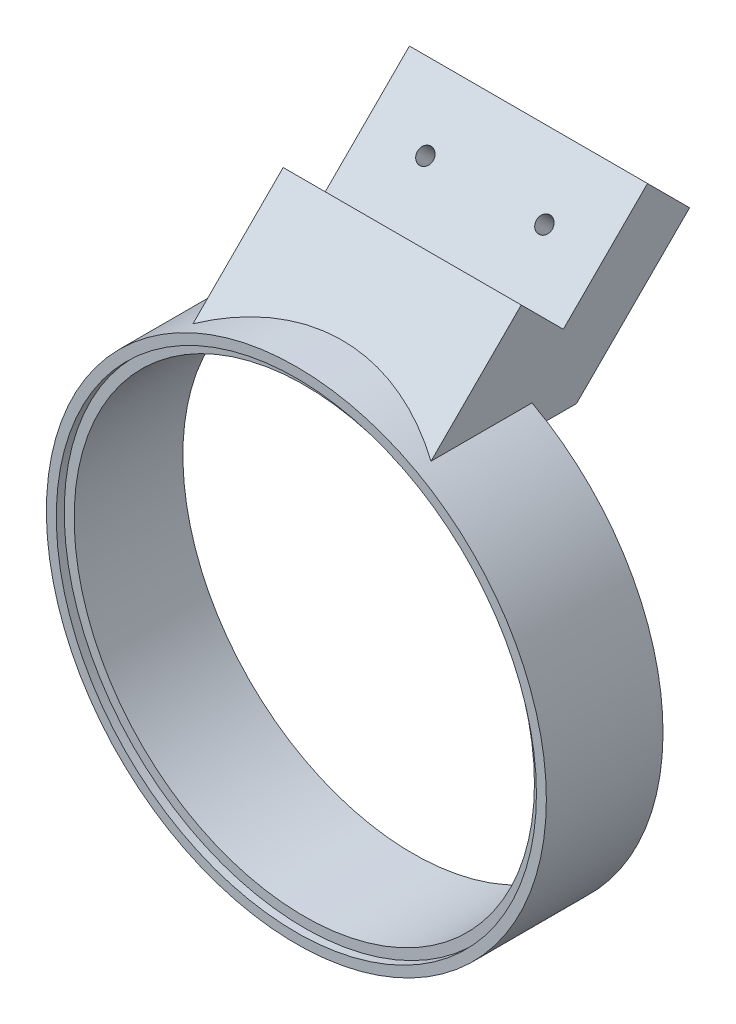
ISO-10303-21;
HEADER;
FILE_DESCRIPTION(('STEP AP214'),'2;1');
FILE_NAME('part.step','',(''),(''),'','','');
FILE_SCHEMA(('AUTOMOTIVE_DESIGN { 1 0 10303 214 1 1 1 1 }'));
ENDSEC;
DATA;
#1=APPLICATION_CONTEXT('core data for automotive mechanical design processes');
#2=APPLICATION_PROTOCOL_DEFINITION('international standard','automotive_design',2000,#1);
#3=PRODUCT_CONTEXT('',#1,'mechanical');
#4=PRODUCT('Part','Part','',(#3));
#5=PRODUCT_RELATED_PRODUCT_CATEGORY('part','',(#4));
#6=PRODUCT_DEFINITION_FORMATION('','',#4);
#7=PRODUCT_DEFINITION_CONTEXT('part definition',#1,'design');
#8=PRODUCT_DEFINITION('design','',#6,#7);
#9=PRODUCT_DEFINITION_SHAPE('','',#8);
#10=(LENGTH_UNIT() NAMED_UNIT(*) SI_UNIT(.MILLI.,.METRE.));
#11=(NAMED_UNIT(*) PLANE_ANGLE_UNIT() SI_UNIT($,.RADIAN.));
#12=(NAMED_UNIT(*) SI_UNIT($,.STERADIAN.) SOLID_ANGLE_UNIT());
#13=UNCERTAINTY_MEASURE_WITH_UNIT(LENGTH_MEASURE(1.E-05),#10,'distance_accuracy_value','');
#14=(GEOMETRIC_REPRESENTATION_CONTEXT(3) GLOBAL_UNCERTAINTY_ASSIGNED_CONTEXT((#13)) GLOBAL_UNIT_ASSIGNED_CONTEXT((#10,
#11,#12)) REPRESENTATION_CONTEXT('',''));
#15=CARTESIAN_POINT('',(0.,0.,0.));
#16=DIRECTION('',(0.,0.,1.));
#17=DIRECTION('',(1.,0.,0.));
#18=AXIS2_PLACEMENT_3D('',#15,#16,#17);
#19=CARTESIAN_POINT('',(0.,0.,29.4));
#20=DIRECTION('',(0.,0.,1.));
#21=DIRECTION('',(1.,0.,0.));
#22=AXIS2_PLACEMENT_3D('',#19,#20,#21);
#23=PLANE('',#22);
#24=CARTESIAN_POINT('',(0.,0.,29.4));
#25=DIRECTION('',(0.,0.,1.));
#26=DIRECTION('',(1.,0.,0.));
#27=AXIS2_PLACEMENT_3D('',#24,#25,#26);
#28=CIRCLE('',#27,60.5);
#29=CARTESIAN_POINT('',(60.5,0.,29.4));
#30=VERTEX_POINT('',#29);
#31=EDGE_CURVE('E157',#30,#30,#28,.T.);
#32=ORIENTED_EDGE('',*,*,#31,.F.);
#33=EDGE_LOOP('',(#32));
#34=FACE_BOUND('',#33,.T.);
#35=CARTESIAN_POINT('',(0.,0.,29.4));
#36=DIRECTION('',(0.,0.,1.));
#37=DIRECTION('',(1.,0.,0.));
#38=AXIS2_PLACEMENT_3D('',#35,#36,#37);
#39=CIRCLE('',#38,63.);
#40=CARTESIAN_POINT('',(63.,0.,29.4));
#41=VERTEX_POINT('',#40);
#42=EDGE_CURVE('E11',#41,#41,#39,.T.);
#43=ORIENTED_EDGE('',*,*,#42,.T.);
#44=EDGE_LOOP('',(#43));
#45=FACE_BOUND('',#44,.T.);
#46=ADVANCED_FACE('F34',(#34,#45),#23,.T.);
#47=CARTESIAN_POINT('',(30.,55.3985559378582,29.4));
#48=DIRECTION('',(1.,0.,0.));
#49=DIRECTION('',(0.,0.,-1.));
#50=AXIS2_PLACEMENT_3D('',#47,#48,#49);
#51=PLANE('',#50);
#52=DIRECTION('',(0.,0.707106781186544,0.707106781186551));
#53=VECTOR('',#52,1.);
#54=CARTESIAN_POINT('',(30.,0.492926244754555,-117.332036564298));
#55=LINE('',#54,#53);
#56=CARTESIAN_POINT('',(30.,78.1279881132385,-39.6969746958128));
#57=VERTEX_POINT('',#56);
#58=CARTESIAN_POINT('',(30.,88.7345898310367,-29.0903729780145));
#59=VERTEX_POINT('',#58);
#60=EDGE_CURVE('E100',#57,#59,#55,.T.);
#61=ORIENTED_EDGE('',*,*,#60,.T.);
#62=DIRECTION('',(0.,0.707106781186551,-0.707106781186544));
#63=VECTOR('',#62,1.);
#64=CARTESIAN_POINT('',(30.,67.5213863954401,-7.87716954241816));
#65=LINE('',#64,#63);
#66=CARTESIAN_POINT('',(30.,67.5213863954401,-7.87716954241816));
#67=VERTEX_POINT('',#66);
#68=EDGE_CURVE('E111',#67,#59,#65,.T.);
#69=ORIENTED_EDGE('',*,*,#68,.F.);
#70=DIRECTION('',(0.,-0.707106781186544,-0.707106781186551));
#71=VECTOR('',#70,1.);
#72=CARTESIAN_POINT('',(30.,78.1279881132386,2.72943217538041));
#73=LINE('',#72,#71);
#74=CARTESIAN_POINT('',(30.,78.1279881132386,2.72943217538041));
#75=VERTEX_POINT('',#74);
#76=EDGE_CURVE('E123',#75,#67,#73,.T.);
#77=ORIENTED_EDGE('',*,*,#76,.F.);
#78=DIRECTION('',(0.,0.707106781186548,-0.707106781186548));
#79=VECTOR('',#78,1.);
#80=CARTESIAN_POINT('',(30.,113.483327172566,-32.625906883947));
#81=LINE('',#80,#79);
#82=CARTESIAN_POINT('',(30.,55.3985559378582,25.4588643507606));
#83=VERTEX_POINT('',#82);
#84=EDGE_CURVE('E130',#83,#75,#81,.T.);
#85=ORIENTED_EDGE('',*,*,#84,.F.);
#86=DIRECTION('',(0.,0.,-1.));
#87=VECTOR('',#86,1.);
#88=CARTESIAN_POINT('',(30.,55.3985559378582,29.4));
#89=LINE('',#88,#87);
#90=CARTESIAN_POINT('',(30.,55.3985559378582,0.));
#91=VERTEX_POINT('',#90);
#92=EDGE_CURVE('E150',#83,#91,#89,.T.);
#93=ORIENTED_EDGE('',*,*,#92,.T.);
#94=DIRECTION('',(0.,-1.,0.));
#95=VECTOR('',#94,1.);
#96=CARTESIAN_POINT('',(30.,0.,0.));
#97=LINE('',#96,#95);
#98=CARTESIAN_POINT('',(30.,49.6386945839634,0.));
#99=VERTEX_POINT('',#98);
#100=EDGE_CURVE('E143',#91,#99,#97,.T.);
#101=ORIENTED_EDGE('',*,*,#100,.T.);
#102=DIRECTION('',(0.,0.,1.));
#103=VECTOR('',#102,1.);
#104=CARTESIAN_POINT('',(30.,49.6386945839634,-53.8391103195437));
#105=LINE('',#104,#103);
#106=CARTESIAN_POINT('',(30.,49.6386945839634,-11.207681166538));
#107=VERTEX_POINT('',#106);
#108=EDGE_CURVE('E135',#107,#99,#105,.T.);
#109=ORIENTED_EDGE('',*,*,#108,.F.);
#110=DIRECTION('',(0.,-0.707106781186551,0.707106781186544));
#111=VECTOR('',#110,1.);
#112=CARTESIAN_POINT('',(30.,92.2701237369695,-53.8391103195436));
#113=LINE('',#112,#111);
#114=EDGE_CURVE('E113',#57,#107,#113,.T.);
#115=ORIENTED_EDGE('',*,*,#114,.F.);
#116=EDGE_LOOP('',(#61,#69,#77,#85,#93,#101,#109,#115));
#117=FACE_BOUND('',#116,.T.);
#118=ADVANCED_FACE('F109',(#117),#51,.T.);
#119=CARTESIAN_POINT('',(-30.,55.3985559378582,29.4));
#120=DIRECTION('',(1.,0.,0.));
#121=DIRECTION('',(0.,0.,-1.));
#122=AXIS2_PLACEMENT_3D('',#119,#120,#121);
#123=PLANE('',#122);
#124=DIRECTION('',(0.,0.707106781186551,-0.707106781186544));
#125=VECTOR('',#124,1.);
#126=CARTESIAN_POINT('',(-30.,67.5213863954401,-7.87716954241816));
#127=LINE('',#126,#125);
#128=CARTESIAN_POINT('',(-30.,67.5213863954401,-7.87716954241816));
#129=VERTEX_POINT('',#128);
#130=CARTESIAN_POINT('',(-30.,88.7345898310367,-29.0903729780145));
#131=VERTEX_POINT('',#130);
#132=EDGE_CURVE('E119',#129,#131,#127,.T.);
#133=ORIENTED_EDGE('',*,*,#132,.T.);
#134=DIRECTION('',(0.,0.707106781186544,0.707106781186551));
#135=VECTOR('',#134,1.);
#136=CARTESIAN_POINT('',(-30.,0.492926244754555,-117.332036564298));
#137=LINE('',#136,#135);
#138=CARTESIAN_POINT('',(-30.,78.1279881132385,-39.6969746958128));
#139=VERTEX_POINT('',#138);
#140=EDGE_CURVE('E49',#139,#131,#137,.T.);
#141=ORIENTED_EDGE('',*,*,#140,.F.);
#142=DIRECTION('',(0.,0.707106781186551,-0.707106781186544));
#143=VECTOR('',#142,1.);
#144=CARTESIAN_POINT('',(-30.,56.9147846776419,-18.4837712602164));
#145=LINE('',#144,#143);
#146=CARTESIAN_POINT('',(-30.,49.6386945839634,-11.207681166538));
#147=VERTEX_POINT('',#146);
#148=EDGE_CURVE('E147',#147,#139,#145,.T.);
#149=ORIENTED_EDGE('',*,*,#148,.F.);
#150=DIRECTION('',(0.,0.,1.));
#151=VECTOR('',#150,1.);
#152=CARTESIAN_POINT('',(-30.,49.6386945839634,-53.8391103195437));
#153=LINE('',#152,#151);
#154=CARTESIAN_POINT('',(-30.,49.6386945839634,0.));
#155=VERTEX_POINT('',#154);
#156=EDGE_CURVE('E133',#147,#155,#153,.T.);
#157=ORIENTED_EDGE('',*,*,#156,.T.);
#158=DIRECTION('',(0.,1.,0.));
#159=VECTOR('',#158,1.);
#160=CARTESIAN_POINT('',(-30.,0.,0.));
#161=LINE('',#160,#159);
#162=CARTESIAN_POINT('',(-30.,55.3985559378582,0.));
#163=VERTEX_POINT('',#162);
#164=EDGE_CURVE('E140',#155,#163,#161,.T.);
#165=ORIENTED_EDGE('',*,*,#164,.T.);
#166=DIRECTION('',(0.,0.,-1.));
#167=VECTOR('',#166,1.);
#168=CARTESIAN_POINT('',(-30.,55.3985559378582,29.4));
#169=LINE('',#168,#167);
#170=CARTESIAN_POINT('',(-30.,55.3985559378582,25.4588643507606));
#171=VERTEX_POINT('',#170);
#172=EDGE_CURVE('E151',#171,#163,#169,.T.);
#173=ORIENTED_EDGE('',*,*,#172,.F.);
#174=DIRECTION('',(0.,-0.707106781186548,0.707106781186548));
#175=VECTOR('',#174,1.);
#176=CARTESIAN_POINT('',(-30.,113.483327172566,-32.625906883947));
#177=LINE('',#176,#175);
#178=CARTESIAN_POINT('',(-30.,78.1279881132385,2.72943217538026));
#179=VERTEX_POINT('',#178);
#180=EDGE_CURVE('E128',#179,#171,#177,.T.);
#181=ORIENTED_EDGE('',*,*,#180,.F.);
#182=DIRECTION('',(0.,0.707106781186544,0.707106781186551));
#183=VECTOR('',#182,1.);
#184=CARTESIAN_POINT('',(-30.,78.1279881132386,2.72943217538041));
#185=LINE('',#184,#183);
#186=EDGE_CURVE('E57',#129,#179,#185,.T.);
#187=ORIENTED_EDGE('',*,*,#186,.F.);
#188=EDGE_LOOP('',(#133,#141,#149,#157,#165,#173,#181,#187));
#189=FACE_BOUND('',#188,.T.);
#190=ADVANCED_FACE('F182',(#189),#123,.F.);
#191=CARTESIAN_POINT('',(0.,0.,29.4));
#192=DIRECTION('',(0.,0.,-1.));
#193=DIRECTION('',(-1.,0.,0.));
#194=AXIS2_PLACEMENT_3D('',#191,#192,#193);
#195=CYLINDRICAL_SURFACE('',#194,58.);
#196=ORIENTED_EDGE('',*,*,#108,.T.);
#197=CARTESIAN_POINT('',(0.,0.,0.));
#198=DIRECTION('',(0.,0.,1.));
#199=DIRECTION('',(1.,0.,0.));
#200=AXIS2_PLACEMENT_3D('',#197,#198,#199);
#201=CIRCLE('',#200,58.);
#202=EDGE_CURVE('E161',#155,#99,#201,.T.);
#203=ORIENTED_EDGE('',*,*,#202,.F.);
#204=ORIENTED_EDGE('',*,*,#156,.F.);
#205=CARTESIAN_POINT('',(0.,0.,38.4310134174249));
#206=DIRECTION('',(0.,-0.707106781186544,-0.707106781186551));
#207=DIRECTION('',(0.,-0.707106781186551,0.707106781186544));
#208=AXIS2_PLACEMENT_3D('',#205,#206,#207);
#209=ELLIPSE('',#208,82.0243866176391,58.);
#210=EDGE_CURVE('E137',#147,#107,#209,.T.);
#211=ORIENTED_EDGE('',*,*,#210,.T.);
#212=EDGE_LOOP('',(#196,#203,#204,#211));
#213=FACE_BOUND('',#212,.T.);
#214=CARTESIAN_POINT('',(0.,0.,27.4));
#215=DIRECTION('',(0.,0.,1.));
#216=DIRECTION('',(1.,0.,0.));
#217=AXIS2_PLACEMENT_3D('',#214,#215,#216);
#218=CIRCLE('',#217,58.);
#219=CARTESIAN_POINT('',(58.,0.,27.4));
#220=VERTEX_POINT('',#219);
#221=EDGE_CURVE('E153',#220,#220,#218,.T.);
#222=ORIENTED_EDGE('',*,*,#221,.T.);
#223=EDGE_LOOP('',(#222));
#224=FACE_BOUND('',#223,.T.);
#225=ADVANCED_FACE('F186',(#213,#224),#195,.F.);
#226=CARTESIAN_POINT('',(0.,0.,0.));
#227=DIRECTION('',(0.,0.,1.));
#228=DIRECTION('',(1.,0.,0.));
#229=AXIS2_PLACEMENT_3D('',#226,#227,#228);
#230=PLANE('',#229);
#231=ORIENTED_EDGE('',*,*,#100,.F.);
#232=CARTESIAN_POINT('',(0.,0.,0.));
#233=DIRECTION('',(0.,0.,1.));
#234=DIRECTION('',(1.,0.,0.));
#235=AXIS2_PLACEMENT_3D('',#232,#233,#234);
#236=CIRCLE('',#235,63.);
#237=EDGE_CURVE('E38',#163,#91,#236,.T.);
#238=ORIENTED_EDGE('',*,*,#237,.F.);
#239=ORIENTED_EDGE('',*,*,#164,.F.);
#240=ORIENTED_EDGE('',*,*,#202,.T.);
#241=EDGE_LOOP('',(#231,#238,#239,#240));
#242=FACE_BOUND('',#241,.T.);
#243=ADVANCED_FACE('F175',(#242),#230,.F.);
#244=CARTESIAN_POINT('',(0.,0.,29.4));
#245=DIRECTION('',(0.,0.,-1.));
#246=DIRECTION('',(-1.,0.,0.));
#247=AXIS2_PLACEMENT_3D('',#244,#245,#246);
#248=CYLINDRICAL_SURFACE('',#247,63.);
#249=ORIENTED_EDGE('',*,*,#92,.F.);
#250=CARTESIAN_POINT('',(0.,0.,80.8574202886188));
#251=DIRECTION('',(0.,0.707106781186548,0.707106781186547));
#252=DIRECTION('',(0.,0.707106781186547,-0.707106781186548));
#253=AXIS2_PLACEMENT_3D('',#250,#251,#252);
#254=ELLIPSE('',#253,89.0954544295051,63.);
#255=EDGE_CURVE('E121',#83,#171,#254,.T.);
#256=ORIENTED_EDGE('',*,*,#255,.T.);
#257=ORIENTED_EDGE('',*,*,#172,.T.);
#258=ORIENTED_EDGE('',*,*,#237,.T.);
#259=EDGE_LOOP('',(#249,#256,#257,#258));
#260=FACE_BOUND('',#259,.T.);
#261=ORIENTED_EDGE('',*,*,#42,.F.);
#262=EDGE_LOOP('',(#261));
#263=FACE_BOUND('',#262,.T.);
#264=ADVANCED_FACE('F36',(#260,#263),#248,.T.);
#265=CARTESIAN_POINT('',(0.,0.,27.4));
#266=DIRECTION('',(0.,0.,1.));
#267=DIRECTION('',(1.,0.,0.));
#268=AXIS2_PLACEMENT_3D('',#265,#266,#267);
#269=CYLINDRICAL_SURFACE('',#268,60.5);
#270=CARTESIAN_POINT('',(0.,0.,27.4));
#271=DIRECTION('',(0.,0.,1.));
#272=DIRECTION('',(1.,0.,0.));
#273=AXIS2_PLACEMENT_3D('',#270,#271,#272);
#274=CIRCLE('',#273,60.5);
#275=CARTESIAN_POINT('',(60.5,0.,27.4));
#276=VERTEX_POINT('',#275);
#277=EDGE_CURVE('E158',#276,#276,#274,.T.);
#278=ORIENTED_EDGE('',*,*,#277,.F.);
#279=EDGE_LOOP('',(#278));
#280=FACE_BOUND('',#279,.T.);
#281=ORIENTED_EDGE('',*,*,#31,.T.);
#282=EDGE_LOOP('',(#281));
#283=FACE_BOUND('',#282,.T.);
#284=ADVANCED_FACE('F237',(#280,#283),#269,.F.);
#285=CARTESIAN_POINT('',(0.,0.,27.4));
#286=DIRECTION('',(0.,0.,1.));
#287=DIRECTION('',(1.,0.,0.));
#288=AXIS2_PLACEMENT_3D('',#285,#286,#287);
#289=PLANE('',#288);
#290=ORIENTED_EDGE('',*,*,#221,.F.);
#291=EDGE_LOOP('',(#290));
#292=FACE_BOUND('',#291,.T.);
#293=ORIENTED_EDGE('',*,*,#277,.T.);
#294=EDGE_LOOP('',(#293));
#295=FACE_BOUND('',#294,.T.);
#296=ADVANCED_FACE('F246',(#292,#295),#289,.T.);
#297=CARTESIAN_POINT('',(0.,19.2155067087125,19.2155067087127));
#298=DIRECTION('',(0.,-0.707106781186544,-0.707106781186551));
#299=DIRECTION('',(0.,0.707106781186551,-0.707106781186544));
#300=AXIS2_PLACEMENT_3D('',#297,#298,#299);
#301=PLANE('',#300);
#302=DIRECTION('',(-1.,0.,0.));
#303=VECTOR('',#302,1.);
#304=CARTESIAN_POINT('',(0.,78.1279881132385,-39.6969746958128));
#305=LINE('',#304,#303);
#306=EDGE_CURVE('E114',#57,#139,#305,.T.);
#307=ORIENTED_EDGE('',*,*,#306,.F.);
#308=ORIENTED_EDGE('',*,*,#114,.T.);
#309=ORIENTED_EDGE('',*,*,#210,.F.);
#310=ORIENTED_EDGE('',*,*,#148,.T.);
#311=EDGE_LOOP('',(#307,#308,#309,#310));
#312=FACE_BOUND('',#311,.T.);
#313=CARTESIAN_POINT('',(15.0000000000001,67.1494516090231,-28.7184381915975));
#314=DIRECTION('',(0.,-0.707106781186544,-0.707106781186551));
#315=DIRECTION('',(0.,0.707106781186551,-0.707106781186544));
#316=AXIS2_PLACEMENT_3D('',#313,#314,#315);
#317=CIRCLE('',#316,2.);
#318=CARTESIAN_POINT('',(15.0000000000001,68.5636651713962,-30.1326517539706));
#319=VERTEX_POINT('',#318);
#320=EDGE_CURVE('E198',#319,#319,#317,.T.);
#321=ORIENTED_EDGE('',*,*,#320,.F.);
#322=EDGE_LOOP('',(#321));
#323=FACE_BOUND('',#322,.T.);
#324=CARTESIAN_POINT('',(-15.,67.1494516090231,-28.7184381915975));
#325=DIRECTION('',(0.,-0.707106781186544,-0.707106781186551));
#326=DIRECTION('',(0.,0.707106781186551,-0.707106781186544));
#327=AXIS2_PLACEMENT_3D('',#324,#325,#326);
#328=CIRCLE('',#327,2.);
#329=CARTESIAN_POINT('',(-15.,68.5636651713962,-30.1326517539706));
#330=VERTEX_POINT('',#329);
#331=EDGE_CURVE('E191',#330,#330,#328,.T.);
#332=ORIENTED_EDGE('',*,*,#331,.F.);
#333=EDGE_LOOP('',(#332));
#334=FACE_BOUND('',#333,.T.);
#335=ADVANCED_FACE('F189',(#312,#323,#334),#301,.T.);
#336=CARTESIAN_POINT('',(-63.001,113.483327172566,-32.625906883947));
#337=DIRECTION('',(0.,-0.707106781186548,-0.707106781186548));
#338=DIRECTION('',(0.,0.707106781186548,-0.707106781186548));
#339=AXIS2_PLACEMENT_3D('',#336,#337,#338);
#340=PLANE('',#339);
#341=ORIENTED_EDGE('',*,*,#84,.T.);
#342=DIRECTION('',(1.,0.,0.));
#343=VECTOR('',#342,1.);
#344=CARTESIAN_POINT('',(-30.,78.1279881132386,2.72943217538041));
#345=LINE('',#344,#343);
#346=EDGE_CURVE('E180',#179,#75,#345,.T.);
#347=ORIENTED_EDGE('',*,*,#346,.F.);
#348=ORIENTED_EDGE('',*,*,#180,.T.);
#349=ORIENTED_EDGE('',*,*,#255,.F.);
#350=EDGE_LOOP('',(#341,#347,#348,#349));
#351=FACE_BOUND('',#350,.T.);
#352=ADVANCED_FACE('F178',(#351),#340,.F.);
#353=CARTESIAN_POINT('',(-30.,67.5213863954401,-7.87716954241816));
#354=DIRECTION('',(0.,-0.707106781186544,-0.707106781186551));
#355=DIRECTION('',(0.,0.707106781186551,-0.707106781186544));
#356=AXIS2_PLACEMENT_3D('',#353,#354,#355);
#357=PLANE('',#356);
#358=CARTESIAN_POINT('',(15.0000000000001,77.7560533268213,-18.1118364737992));
#359=DIRECTION('',(0.,-0.707106781186544,-0.707106781186551));
#360=DIRECTION('',(0.,0.707106781186551,-0.707106781186544));
#361=AXIS2_PLACEMENT_3D('',#358,#359,#360);
#362=CIRCLE('',#361,2.);
#363=CARTESIAN_POINT('',(15.0000000000001,79.1702668891944,-19.5260500361723));
#364=VERTEX_POINT('',#363);
#365=EDGE_CURVE('E201',#364,#364,#362,.F.);
#366=ORIENTED_EDGE('',*,*,#365,.F.);
#367=EDGE_LOOP('',(#366));
#368=FACE_BOUND('',#367,.T.);
#369=CARTESIAN_POINT('',(-15.,77.7560533268213,-18.1118364737992));
#370=DIRECTION('',(0.,-0.707106781186544,-0.707106781186551));
#371=DIRECTION('',(0.,0.707106781186551,-0.707106781186544));
#372=AXIS2_PLACEMENT_3D('',#369,#370,#371);
#373=CIRCLE('',#372,2.);
#374=CARTESIAN_POINT('',(-15.,79.1702668891944,-19.5260500361723));
#375=VERTEX_POINT('',#374);
#376=EDGE_CURVE('E194',#375,#375,#373,.F.);
#377=ORIENTED_EDGE('',*,*,#376,.F.);
#378=EDGE_LOOP('',(#377));
#379=FACE_BOUND('',#378,.T.);
#380=ORIENTED_EDGE('',*,*,#68,.T.);
#381=DIRECTION('',(1.,0.,0.));
#382=VECTOR('',#381,1.);
#383=CARTESIAN_POINT('',(-30.,88.7345898310367,-29.0903729780145));
#384=LINE('',#383,#382);
#385=EDGE_CURVE('E97',#131,#59,#384,.T.);
#386=ORIENTED_EDGE('',*,*,#385,.F.);
#387=ORIENTED_EDGE('',*,*,#132,.F.);
#388=DIRECTION('',(-1.,0.,0.));
#389=VECTOR('',#388,1.);
#390=CARTESIAN_POINT('',(-30.,67.5213863954401,-7.87716954241816));
#391=LINE('',#390,#389);
#392=EDGE_CURVE('E118',#67,#129,#391,.T.);
#393=ORIENTED_EDGE('',*,*,#392,.F.);
#394=EDGE_LOOP('',(#380,#386,#387,#393));
#395=FACE_BOUND('',#394,.T.);
#396=ADVANCED_FACE('F117',(#368,#379,#395),#357,.F.);
#397=CARTESIAN_POINT('',(0.,37.6992779689295,-37.6992779689291));
#398=DIRECTION('',(0.,-0.707106781186551,0.707106781186544));
#399=DIRECTION('',(0.,-0.707106781186544,-0.707106781186551));
#400=AXIS2_PLACEMENT_3D('',#397,#398,#399);
#401=PLANE('',#400);
#402=ORIENTED_EDGE('',*,*,#186,.T.);
#403=ORIENTED_EDGE('',*,*,#346,.T.);
#404=ORIENTED_EDGE('',*,*,#76,.T.);
#405=ORIENTED_EDGE('',*,*,#392,.T.);
#406=EDGE_LOOP('',(#402,#403,#404,#405));
#407=FACE_BOUND('',#406,.T.);
#408=ADVANCED_FACE('F208',(#407),#401,.F.);
#409=CARTESIAN_POINT('',(-14.9999999999999,81.7560533268213,-14.1118364737992));
#410=DIRECTION('',(0.,-0.707106781186544,-0.707106781186551));
#411=DIRECTION('',(0.,0.707106781186551,-0.707106781186544));
#412=AXIS2_PLACEMENT_3D('',#409,#410,#411);
#413=CYLINDRICAL_SURFACE('',#412,2.);
#414=ORIENTED_EDGE('',*,*,#376,.T.);
#415=EDGE_LOOP('',(#414));
#416=FACE_BOUND('',#415,.T.);
#417=ORIENTED_EDGE('',*,*,#331,.T.);
#418=EDGE_LOOP('',(#417));
#419=FACE_BOUND('',#418,.T.);
#420=ADVANCED_FACE('F210',(#416,#419),#413,.F.);
#421=CARTESIAN_POINT('',(15.0000000000001,81.7560533268213,-14.1118364737992));
#422=DIRECTION('',(0.,-0.707106781186544,-0.707106781186551));
#423=DIRECTION('',(0.,0.707106781186551,-0.707106781186544));
#424=AXIS2_PLACEMENT_3D('',#421,#422,#423);
#425=CYLINDRICAL_SURFACE('',#424,2.);
#426=ORIENTED_EDGE('',*,*,#365,.T.);
#427=EDGE_LOOP('',(#426));
#428=FACE_BOUND('',#427,.T.);
#429=ORIENTED_EDGE('',*,*,#320,.T.);
#430=EDGE_LOOP('',(#429));
#431=FACE_BOUND('',#430,.T.);
#432=ADVANCED_FACE('F216',(#428,#431),#425,.F.);
#433=CARTESIAN_POINT('',(-30.,0.492926244754555,-117.332036564298));
#434=DIRECTION('',(0.,-0.707106781186551,0.707106781186544));
#435=DIRECTION('',(0.,-0.707106781186544,-0.707106781186551));
#436=AXIS2_PLACEMENT_3D('',#433,#434,#435);
#437=PLANE('',#436);
#438=ORIENTED_EDGE('',*,*,#306,.T.);
#439=ORIENTED_EDGE('',*,*,#140,.T.);
#440=ORIENTED_EDGE('',*,*,#385,.T.);
#441=ORIENTED_EDGE('',*,*,#60,.F.);
#442=EDGE_LOOP('',(#438,#439,#440,#441));
#443=FACE_BOUND('',#442,.T.);
#444=ADVANCED_FACE('F99',(#443),#437,.F.);
#445=CLOSED_SHELL('',(#46,#118,#190,#225,#243,#264,#284,#296,#335,#352,#396,#408,#420,#432,#444));
#446=MANIFOLD_SOLID_BREP('B2',#445);
#447=ADVANCED_BREP_SHAPE_REPRESENTATION('',(#18,#446),#14);
#448=SHAPE_DEFINITION_REPRESENTATION(#9,#447);
ENDSEC;
END-ISO-10303-21;
